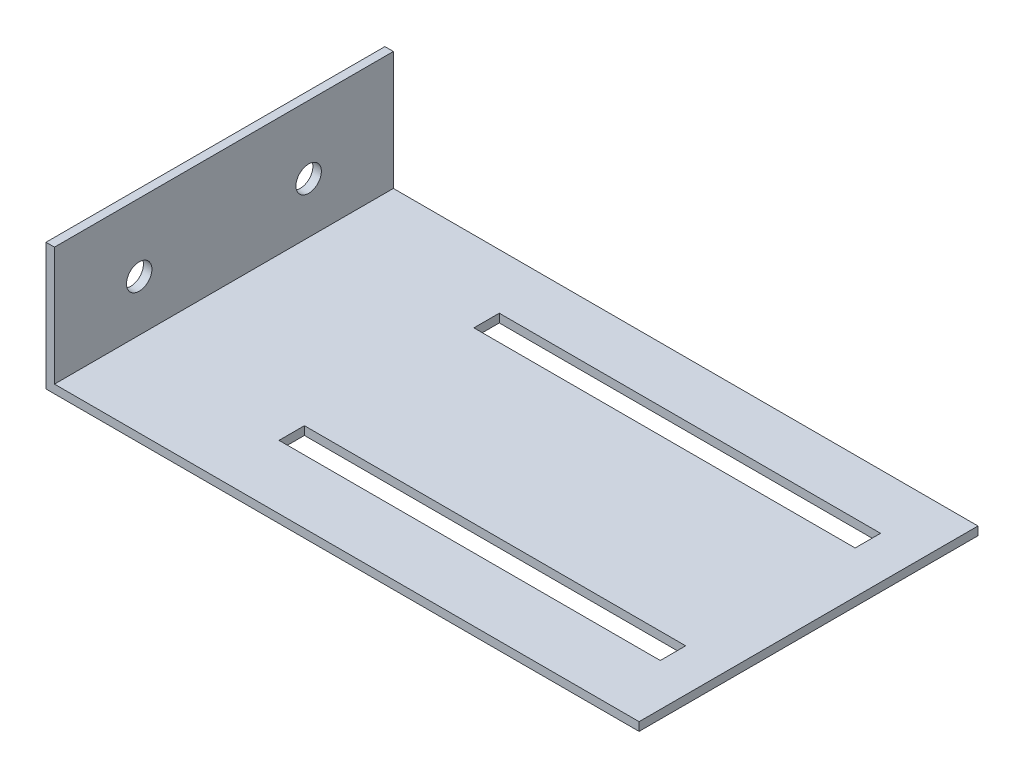
ISO-10303-21;
HEADER;
FILE_DESCRIPTION(('STEP AP214'),'2;1');
FILE_NAME('part.step','',(''),(''),'','','');
FILE_SCHEMA(('AUTOMOTIVE_DESIGN { 1 0 10303 214 1 1 1 1 }'));
ENDSEC;
DATA;
#1=APPLICATION_CONTEXT('core data for automotive mechanical design processes');
#2=APPLICATION_PROTOCOL_DEFINITION('international standard','automotive_design',2000,#1);
#3=PRODUCT_CONTEXT('',#1,'mechanical');
#4=PRODUCT('Part','Part','',(#3));
#5=PRODUCT_RELATED_PRODUCT_CATEGORY('part','',(#4));
#6=PRODUCT_DEFINITION_FORMATION('','',#4);
#7=PRODUCT_DEFINITION_CONTEXT('part definition',#1,'design');
#8=PRODUCT_DEFINITION('design','',#6,#7);
#9=PRODUCT_DEFINITION_SHAPE('','',#8);
#10=(LENGTH_UNIT() NAMED_UNIT(*) SI_UNIT(.MILLI.,.METRE.));
#11=(NAMED_UNIT(*) PLANE_ANGLE_UNIT() SI_UNIT($,.RADIAN.));
#12=(NAMED_UNIT(*) SI_UNIT($,.STERADIAN.) SOLID_ANGLE_UNIT());
#13=UNCERTAINTY_MEASURE_WITH_UNIT(LENGTH_MEASURE(1.E-05),#10,'distance_accuracy_value','');
#14=(GEOMETRIC_REPRESENTATION_CONTEXT(3) GLOBAL_UNCERTAINTY_ASSIGNED_CONTEXT((#13)) GLOBAL_UNIT_ASSIGNED_CONTEXT((#10,
#11,#12)) REPRESENTATION_CONTEXT('',''));
#15=CARTESIAN_POINT('',(0.,0.,0.));
#16=DIRECTION('',(0.,0.,1.));
#17=DIRECTION('',(1.,0.,0.));
#18=AXIS2_PLACEMENT_3D('',#15,#16,#17);
#19=CARTESIAN_POINT('',(0.,15.,40.));
#20=DIRECTION('',(1.,0.,0.));
#21=DIRECTION('',(0.,1.,0.));
#22=AXIS2_PLACEMENT_3D('',#19,#20,#21);
#23=PLANE('',#22);
#24=CARTESIAN_POINT('',(0.,7.,30.));
#25=DIRECTION('',(-1.,0.,0.));
#26=DIRECTION('',(0.,-1.,0.));
#27=AXIS2_PLACEMENT_3D('',#24,#25,#26);
#28=CIRCLE('',#27,1.5);
#29=CARTESIAN_POINT('',(0.,5.5,30.));
#30=VERTEX_POINT('',#29);
#31=EDGE_CURVE('E245',#30,#30,#28,.T.);
#32=ORIENTED_EDGE('',*,*,#31,.F.);
#33=EDGE_LOOP('',(#32));
#34=FACE_BOUND('',#33,.T.);
#35=CARTESIAN_POINT('',(0.,7.,10.));
#36=DIRECTION('',(-1.,0.,0.));
#37=DIRECTION('',(0.,-1.,0.));
#38=AXIS2_PLACEMENT_3D('',#35,#36,#37);
#39=CIRCLE('',#38,1.5);
#40=CARTESIAN_POINT('',(0.,5.5,10.));
#41=VERTEX_POINT('',#40);
#42=EDGE_CURVE('E250',#41,#41,#39,.T.);
#43=ORIENTED_EDGE('',*,*,#42,.F.);
#44=EDGE_LOOP('',(#43));
#45=FACE_BOUND('',#44,.T.);
#46=DIRECTION('',(0.,-1.,0.));
#47=VECTOR('',#46,1.);
#48=CARTESIAN_POINT('',(0.,15.,0.));
#49=LINE('',#48,#47);
#50=CARTESIAN_POINT('',(0.,15.,0.));
#51=VERTEX_POINT('',#50);
#52=CARTESIAN_POINT('',(0.,0.,0.));
#53=VERTEX_POINT('',#52);
#54=EDGE_CURVE('E204',#51,#53,#49,.T.);
#55=ORIENTED_EDGE('',*,*,#54,.T.);
#56=DIRECTION('',(0.,0.,-1.));
#57=VECTOR('',#56,1.);
#58=CARTESIAN_POINT('',(0.,0.,40.));
#59=LINE('',#58,#57);
#60=CARTESIAN_POINT('',(0.,0.,40.));
#61=VERTEX_POINT('',#60);
#62=EDGE_CURVE('E11',#61,#53,#59,.T.);
#63=ORIENTED_EDGE('',*,*,#62,.F.);
#64=DIRECTION('',(0.,-1.,0.));
#65=VECTOR('',#64,1.);
#66=CARTESIAN_POINT('',(0.,15.,40.));
#67=LINE('',#66,#65);
#68=CARTESIAN_POINT('',(0.,15.,40.));
#69=VERTEX_POINT('',#68);
#70=EDGE_CURVE('E205',#69,#61,#67,.T.);
#71=ORIENTED_EDGE('',*,*,#70,.F.);
#72=DIRECTION('',(0.,0.,-1.));
#73=VECTOR('',#72,1.);
#74=CARTESIAN_POINT('',(0.,15.,40.));
#75=LINE('',#74,#73);
#76=EDGE_CURVE('E219',#69,#51,#75,.T.);
#77=ORIENTED_EDGE('',*,*,#76,.T.);
#78=EDGE_LOOP('',(#55,#63,#71,#77));
#79=FACE_BOUND('',#78,.T.);
#80=ADVANCED_FACE('F32',(#34,#45,#79),#23,.F.);
#81=CARTESIAN_POINT('',(0.,0.,40.));
#82=DIRECTION('',(0.,1.,0.));
#83=DIRECTION('',(0.,0.,1.));
#84=AXIS2_PLACEMENT_3D('',#81,#82,#83);
#85=PLANE('',#84);
#86=DIRECTION('',(-1.,0.,0.));
#87=VECTOR('',#86,1.);
#88=CARTESIAN_POINT('',(0.,0.,6.50000000000002));
#89=LINE('',#88,#87);
#90=CARTESIAN_POINT('',(65.,0.,6.50000000000002));
#91=VERTEX_POINT('',#90);
#92=CARTESIAN_POINT('',(20.,0.,6.50000000000002));
#93=VERTEX_POINT('',#92);
#94=EDGE_CURVE('E198',#91,#93,#89,.T.);
#95=ORIENTED_EDGE('',*,*,#94,.T.);
#96=DIRECTION('',(0.,0.,1.));
#97=VECTOR('',#96,1.);
#98=CARTESIAN_POINT('',(20.,0.,40.));
#99=LINE('',#98,#97);
#100=CARTESIAN_POINT('',(20.,0.,9.50000000000002));
#101=VERTEX_POINT('',#100);
#102=EDGE_CURVE('E201',#93,#101,#99,.T.);
#103=ORIENTED_EDGE('',*,*,#102,.T.);
#104=DIRECTION('',(1.,0.,0.));
#105=VECTOR('',#104,1.);
#106=CARTESIAN_POINT('',(0.,0.,9.50000000000002));
#107=LINE('',#106,#105);
#108=CARTESIAN_POINT('',(65.,0.,9.50000000000002));
#109=VERTEX_POINT('',#108);
#110=EDGE_CURVE('E195',#101,#109,#107,.T.);
#111=ORIENTED_EDGE('',*,*,#110,.T.);
#112=DIRECTION('',(0.,0.,-1.));
#113=VECTOR('',#112,1.);
#114=CARTESIAN_POINT('',(65.,0.,40.));
#115=LINE('',#114,#113);
#116=EDGE_CURVE('E139',#109,#91,#115,.T.);
#117=ORIENTED_EDGE('',*,*,#116,.T.);
#118=EDGE_LOOP('',(#95,#103,#111,#117));
#119=FACE_BOUND('',#118,.T.);
#120=DIRECTION('',(-1.,0.,0.));
#121=VECTOR('',#120,1.);
#122=CARTESIAN_POINT('',(0.,0.,29.5));
#123=LINE('',#122,#121);
#124=CARTESIAN_POINT('',(65.,0.,29.5));
#125=VERTEX_POINT('',#124);
#126=CARTESIAN_POINT('',(20.,0.,29.5));
#127=VERTEX_POINT('',#126);
#128=EDGE_CURVE('E189',#125,#127,#123,.T.);
#129=ORIENTED_EDGE('',*,*,#128,.T.);
#130=DIRECTION('',(0.,0.,1.));
#131=VECTOR('',#130,1.);
#132=CARTESIAN_POINT('',(20.,0.,40.));
#133=LINE('',#132,#131);
#134=CARTESIAN_POINT('',(20.,0.,32.5));
#135=VERTEX_POINT('',#134);
#136=EDGE_CURVE('E192',#127,#135,#133,.T.);
#137=ORIENTED_EDGE('',*,*,#136,.T.);
#138=DIRECTION('',(1.,0.,0.));
#139=VECTOR('',#138,1.);
#140=CARTESIAN_POINT('',(0.,0.,32.5));
#141=LINE('',#140,#139);
#142=CARTESIAN_POINT('',(65.,0.,32.5));
#143=VERTEX_POINT('',#142);
#144=EDGE_CURVE('E163',#135,#143,#141,.T.);
#145=ORIENTED_EDGE('',*,*,#144,.T.);
#146=DIRECTION('',(0.,0.,-1.));
#147=VECTOR('',#146,1.);
#148=CARTESIAN_POINT('',(65.,0.,40.));
#149=LINE('',#148,#147);
#150=EDGE_CURVE('E186',#143,#125,#149,.T.);
#151=ORIENTED_EDGE('',*,*,#150,.T.);
#152=EDGE_LOOP('',(#129,#137,#145,#151));
#153=FACE_BOUND('',#152,.T.);
#154=DIRECTION('',(1.,0.,0.));
#155=VECTOR('',#154,1.);
#156=CARTESIAN_POINT('',(0.,0.,0.));
#157=LINE('',#156,#155);
#158=CARTESIAN_POINT('',(70.,0.,0.));
#159=VERTEX_POINT('',#158);
#160=EDGE_CURVE('E222',#53,#159,#157,.T.);
#161=ORIENTED_EDGE('',*,*,#160,.T.);
#162=DIRECTION('',(0.,0.,-1.));
#163=VECTOR('',#162,1.);
#164=CARTESIAN_POINT('',(70.,0.,40.));
#165=LINE('',#164,#163);
#166=CARTESIAN_POINT('',(70.,0.,40.));
#167=VERTEX_POINT('',#166);
#168=EDGE_CURVE('E40',#167,#159,#165,.T.);
#169=ORIENTED_EDGE('',*,*,#168,.F.);
#170=DIRECTION('',(1.,0.,0.));
#171=VECTOR('',#170,1.);
#172=CARTESIAN_POINT('',(0.,0.,40.));
#173=LINE('',#172,#171);
#174=EDGE_CURVE('E208',#61,#167,#173,.T.);
#175=ORIENTED_EDGE('',*,*,#174,.F.);
#176=ORIENTED_EDGE('',*,*,#62,.T.);
#177=EDGE_LOOP('',(#161,#169,#175,#176));
#178=FACE_BOUND('',#177,.T.);
#179=ADVANCED_FACE('F262',(#119,#153,#178),#85,.F.);
#180=CARTESIAN_POINT('',(70.,0.,40.));
#181=DIRECTION('',(-1.,0.,0.));
#182=DIRECTION('',(0.,0.,1.));
#183=AXIS2_PLACEMENT_3D('',#180,#181,#182);
#184=PLANE('',#183);
#185=DIRECTION('',(0.,1.,0.));
#186=VECTOR('',#185,1.);
#187=CARTESIAN_POINT('',(70.,0.,0.));
#188=LINE('',#187,#186);
#189=CARTESIAN_POINT('',(70.,1.,0.));
#190=VERTEX_POINT('',#189);
#191=EDGE_CURVE('E224',#159,#190,#188,.T.);
#192=ORIENTED_EDGE('',*,*,#191,.T.);
#193=DIRECTION('',(0.,0.,-1.));
#194=VECTOR('',#193,1.);
#195=CARTESIAN_POINT('',(70.,1.,40.));
#196=LINE('',#195,#194);
#197=CARTESIAN_POINT('',(70.,1.,40.));
#198=VERTEX_POINT('',#197);
#199=EDGE_CURVE('E239',#198,#190,#196,.T.);
#200=ORIENTED_EDGE('',*,*,#199,.F.);
#201=DIRECTION('',(0.,1.,0.));
#202=VECTOR('',#201,1.);
#203=CARTESIAN_POINT('',(70.,0.,40.));
#204=LINE('',#203,#202);
#205=EDGE_CURVE('E211',#167,#198,#204,.T.);
#206=ORIENTED_EDGE('',*,*,#205,.F.);
#207=ORIENTED_EDGE('',*,*,#168,.T.);
#208=EDGE_LOOP('',(#192,#200,#206,#207));
#209=FACE_BOUND('',#208,.T.);
#210=ADVANCED_FACE('F265',(#209),#184,.F.);
#211=CARTESIAN_POINT('',(70.,1.,40.));
#212=DIRECTION('',(0.,-1.,0.));
#213=DIRECTION('',(1.,0.,0.));
#214=AXIS2_PLACEMENT_3D('',#211,#212,#213);
#215=PLANE('',#214);
#216=DIRECTION('',(1.,0.,0.));
#217=VECTOR('',#216,1.);
#218=CARTESIAN_POINT('',(20.,1.,9.50000000000002));
#219=LINE('',#218,#217);
#220=CARTESIAN_POINT('',(20.,1.,9.50000000000002));
#221=VERTEX_POINT('',#220);
#222=CARTESIAN_POINT('',(65.,1.,9.50000000000002));
#223=VERTEX_POINT('',#222);
#224=EDGE_CURVE('E146',#221,#223,#219,.T.);
#225=ORIENTED_EDGE('',*,*,#224,.F.);
#226=DIRECTION('',(0.,0.,1.));
#227=VECTOR('',#226,1.);
#228=CARTESIAN_POINT('',(20.,1.,6.50000000000002));
#229=LINE('',#228,#227);
#230=CARTESIAN_POINT('',(20.,1.,6.50000000000002));
#231=VERTEX_POINT('',#230);
#232=EDGE_CURVE('E151',#231,#221,#229,.T.);
#233=ORIENTED_EDGE('',*,*,#232,.F.);
#234=DIRECTION('',(-1.,0.,0.));
#235=VECTOR('',#234,1.);
#236=CARTESIAN_POINT('',(20.,1.,6.50000000000002));
#237=LINE('',#236,#235);
#238=CARTESIAN_POINT('',(65.,1.,6.50000000000002));
#239=VERTEX_POINT('',#238);
#240=EDGE_CURVE('E156',#239,#231,#237,.T.);
#241=ORIENTED_EDGE('',*,*,#240,.F.);
#242=DIRECTION('',(0.,0.,-1.));
#243=VECTOR('',#242,1.);
#244=CARTESIAN_POINT('',(65.,1.,6.50000000000002));
#245=LINE('',#244,#243);
#246=EDGE_CURVE('E136',#223,#239,#245,.T.);
#247=ORIENTED_EDGE('',*,*,#246,.F.);
#248=EDGE_LOOP('',(#225,#233,#241,#247));
#249=FACE_BOUND('',#248,.T.);
#250=DIRECTION('',(1.,0.,0.));
#251=VECTOR('',#250,1.);
#252=CARTESIAN_POINT('',(20.,1.,32.5));
#253=LINE('',#252,#251);
#254=CARTESIAN_POINT('',(20.,1.,32.5));
#255=VERTEX_POINT('',#254);
#256=CARTESIAN_POINT('',(65.,1.,32.5));
#257=VERTEX_POINT('',#256);
#258=EDGE_CURVE('E168',#255,#257,#253,.T.);
#259=ORIENTED_EDGE('',*,*,#258,.F.);
#260=DIRECTION('',(0.,0.,1.));
#261=VECTOR('',#260,1.);
#262=CARTESIAN_POINT('',(20.,1.,32.5));
#263=LINE('',#262,#261);
#264=CARTESIAN_POINT('',(20.,1.,29.5));
#265=VERTEX_POINT('',#264);
#266=EDGE_CURVE('E166',#265,#255,#263,.T.);
#267=ORIENTED_EDGE('',*,*,#266,.F.);
#268=DIRECTION('',(-1.,0.,0.));
#269=VECTOR('',#268,1.);
#270=CARTESIAN_POINT('',(20.,1.,29.5));
#271=LINE('',#270,#269);
#272=CARTESIAN_POINT('',(65.,1.,29.5));
#273=VERTEX_POINT('',#272);
#274=EDGE_CURVE('E173',#273,#265,#271,.T.);
#275=ORIENTED_EDGE('',*,*,#274,.F.);
#276=DIRECTION('',(0.,0.,-1.));
#277=VECTOR('',#276,1.);
#278=CARTESIAN_POINT('',(65.,1.,32.5));
#279=LINE('',#278,#277);
#280=EDGE_CURVE('E170',#257,#273,#279,.T.);
#281=ORIENTED_EDGE('',*,*,#280,.F.);
#282=EDGE_LOOP('',(#259,#267,#275,#281));
#283=FACE_BOUND('',#282,.T.);
#284=DIRECTION('',(-1.,0.,0.));
#285=VECTOR('',#284,1.);
#286=CARTESIAN_POINT('',(70.,1.,0.));
#287=LINE('',#286,#285);
#288=CARTESIAN_POINT('',(1.00000000000001,1.,0.));
#289=VERTEX_POINT('',#288);
#290=EDGE_CURVE('E226',#190,#289,#287,.T.);
#291=ORIENTED_EDGE('',*,*,#290,.T.);
#292=DIRECTION('',(0.,0.,-1.));
#293=VECTOR('',#292,1.);
#294=CARTESIAN_POINT('',(1.00000000000001,1.,40.));
#295=LINE('',#294,#293);
#296=CARTESIAN_POINT('',(1.00000000000001,1.,40.));
#297=VERTEX_POINT('',#296);
#298=EDGE_CURVE('E236',#297,#289,#295,.T.);
#299=ORIENTED_EDGE('',*,*,#298,.F.);
#300=DIRECTION('',(-1.,0.,0.));
#301=VECTOR('',#300,1.);
#302=CARTESIAN_POINT('',(70.,1.,40.));
#303=LINE('',#302,#301);
#304=EDGE_CURVE('E213',#198,#297,#303,.T.);
#305=ORIENTED_EDGE('',*,*,#304,.F.);
#306=ORIENTED_EDGE('',*,*,#199,.T.);
#307=EDGE_LOOP('',(#291,#299,#305,#306));
#308=FACE_BOUND('',#307,.T.);
#309=ADVANCED_FACE('F153',(#249,#283,#308),#215,.F.);
#310=CARTESIAN_POINT('',(1.00000000000001,1.,40.));
#311=DIRECTION('',(-1.,0.,0.));
#312=DIRECTION('',(0.,0.,1.));
#313=AXIS2_PLACEMENT_3D('',#310,#311,#312);
#314=PLANE('',#313);
#315=CARTESIAN_POINT('',(1.00000000000001,7.,30.));
#316=DIRECTION('',(-1.,0.,0.));
#317=DIRECTION('',(0.,0.,1.));
#318=AXIS2_PLACEMENT_3D('',#315,#316,#317);
#319=CIRCLE('',#318,1.5);
#320=CARTESIAN_POINT('',(1.00000000000001,7.,31.5));
#321=VERTEX_POINT('',#320);
#322=EDGE_CURVE('E35',#321,#321,#319,.T.);
#323=ORIENTED_EDGE('',*,*,#322,.T.);
#324=EDGE_LOOP('',(#323));
#325=FACE_BOUND('',#324,.T.);
#326=CARTESIAN_POINT('',(1.00000000000001,7.,10.));
#327=DIRECTION('',(-1.,0.,0.));
#328=DIRECTION('',(0.,0.,1.));
#329=AXIS2_PLACEMENT_3D('',#326,#327,#328);
#330=CIRCLE('',#329,1.5);
#331=CARTESIAN_POINT('',(1.00000000000001,7.,11.5));
#332=VERTEX_POINT('',#331);
#333=EDGE_CURVE('E243',#332,#332,#330,.T.);
#334=ORIENTED_EDGE('',*,*,#333,.T.);
#335=EDGE_LOOP('',(#334));
#336=FACE_BOUND('',#335,.T.);
#337=DIRECTION('',(0.,1.,0.));
#338=VECTOR('',#337,1.);
#339=CARTESIAN_POINT('',(1.00000000000001,1.,0.));
#340=LINE('',#339,#338);
#341=CARTESIAN_POINT('',(1.00000000000001,15.,0.));
#342=VERTEX_POINT('',#341);
#343=EDGE_CURVE('E228',#289,#342,#340,.T.);
#344=ORIENTED_EDGE('',*,*,#343,.T.);
#345=DIRECTION('',(0.,0.,-1.));
#346=VECTOR('',#345,1.);
#347=CARTESIAN_POINT('',(1.00000000000001,15.,40.));
#348=LINE('',#347,#346);
#349=CARTESIAN_POINT('',(1.00000000000001,15.,40.));
#350=VERTEX_POINT('',#349);
#351=EDGE_CURVE('E233',#350,#342,#348,.T.);
#352=ORIENTED_EDGE('',*,*,#351,.F.);
#353=DIRECTION('',(0.,1.,0.));
#354=VECTOR('',#353,1.);
#355=CARTESIAN_POINT('',(1.00000000000001,1.,40.));
#356=LINE('',#355,#354);
#357=EDGE_CURVE('E215',#297,#350,#356,.T.);
#358=ORIENTED_EDGE('',*,*,#357,.F.);
#359=ORIENTED_EDGE('',*,*,#298,.T.);
#360=EDGE_LOOP('',(#344,#352,#358,#359));
#361=FACE_BOUND('',#360,.T.);
#362=ADVANCED_FACE('F284',(#325,#336,#361),#314,.F.);
#363=CARTESIAN_POINT('',(1.00000000000001,15.,40.));
#364=DIRECTION('',(0.,-1.,0.));
#365=DIRECTION('',(0.,0.,-1.));
#366=AXIS2_PLACEMENT_3D('',#363,#364,#365);
#367=PLANE('',#366);
#368=DIRECTION('',(-1.,0.,0.));
#369=VECTOR('',#368,1.);
#370=CARTESIAN_POINT('',(1.00000000000001,15.,0.));
#371=LINE('',#370,#369);
#372=EDGE_CURVE('E209',#342,#51,#371,.T.);
#373=ORIENTED_EDGE('',*,*,#372,.T.);
#374=ORIENTED_EDGE('',*,*,#76,.F.);
#375=DIRECTION('',(-1.,0.,0.));
#376=VECTOR('',#375,1.);
#377=CARTESIAN_POINT('',(1.00000000000001,15.,40.));
#378=LINE('',#377,#376);
#379=EDGE_CURVE('E217',#350,#69,#378,.T.);
#380=ORIENTED_EDGE('',*,*,#379,.F.);
#381=ORIENTED_EDGE('',*,*,#351,.T.);
#382=EDGE_LOOP('',(#373,#374,#380,#381));
#383=FACE_BOUND('',#382,.T.);
#384=ADVANCED_FACE('F293',(#383),#367,.F.);
#385=CARTESIAN_POINT('',(0.,0.,40.));
#386=DIRECTION('',(0.,0.,1.));
#387=DIRECTION('',(1.,0.,0.));
#388=AXIS2_PLACEMENT_3D('',#385,#386,#387);
#389=PLANE('',#388);
#390=ORIENTED_EDGE('',*,*,#70,.T.);
#391=ORIENTED_EDGE('',*,*,#174,.T.);
#392=ORIENTED_EDGE('',*,*,#205,.T.);
#393=ORIENTED_EDGE('',*,*,#304,.T.);
#394=ORIENTED_EDGE('',*,*,#357,.T.);
#395=ORIENTED_EDGE('',*,*,#379,.T.);
#396=EDGE_LOOP('',(#390,#391,#392,#393,#394,#395));
#397=FACE_BOUND('',#396,.T.);
#398=ADVANCED_FACE('F288',(#397),#389,.T.);
#399=CARTESIAN_POINT('',(0.,0.,0.));
#400=DIRECTION('',(0.,0.,1.));
#401=DIRECTION('',(1.,0.,0.));
#402=AXIS2_PLACEMENT_3D('',#399,#400,#401);
#403=PLANE('',#402);
#404=ORIENTED_EDGE('',*,*,#54,.F.);
#405=ORIENTED_EDGE('',*,*,#372,.F.);
#406=ORIENTED_EDGE('',*,*,#343,.F.);
#407=ORIENTED_EDGE('',*,*,#290,.F.);
#408=ORIENTED_EDGE('',*,*,#191,.F.);
#409=ORIENTED_EDGE('',*,*,#160,.F.);
#410=EDGE_LOOP('',(#404,#405,#406,#407,#408,#409));
#411=FACE_BOUND('',#410,.T.);
#412=ADVANCED_FACE('F276',(#411),#403,.F.);
#413=CARTESIAN_POINT('',(20.,-9.,32.5));
#414=DIRECTION('',(-1.,0.,0.));
#415=DIRECTION('',(0.,0.,1.));
#416=AXIS2_PLACEMENT_3D('',#413,#414,#415);
#417=PLANE('',#416);
#418=DIRECTION('',(0.,1.,0.));
#419=VECTOR('',#418,1.);
#420=CARTESIAN_POINT('',(20.,-9.,29.5));
#421=LINE('',#420,#419);
#422=EDGE_CURVE('E177',#127,#265,#421,.T.);
#423=ORIENTED_EDGE('',*,*,#422,.T.);
#424=ORIENTED_EDGE('',*,*,#266,.T.);
#425=DIRECTION('',(0.,1.,0.));
#426=VECTOR('',#425,1.);
#427=CARTESIAN_POINT('',(20.,-9.,32.5));
#428=LINE('',#427,#426);
#429=EDGE_CURVE('E176',#135,#255,#428,.T.);
#430=ORIENTED_EDGE('',*,*,#429,.F.);
#431=ORIENTED_EDGE('',*,*,#136,.F.);
#432=EDGE_LOOP('',(#423,#424,#430,#431));
#433=FACE_BOUND('',#432,.T.);
#434=ADVANCED_FACE('F334',(#433),#417,.F.);
#435=CARTESIAN_POINT('',(20.,-9.,29.5));
#436=DIRECTION('',(0.,0.,-1.));
#437=DIRECTION('',(-1.,0.,0.));
#438=AXIS2_PLACEMENT_3D('',#435,#436,#437);
#439=PLANE('',#438);
#440=DIRECTION('',(0.,1.,0.));
#441=VECTOR('',#440,1.);
#442=CARTESIAN_POINT('',(65.,-9.,29.5));
#443=LINE('',#442,#441);
#444=EDGE_CURVE('E179',#125,#273,#443,.T.);
#445=ORIENTED_EDGE('',*,*,#444,.T.);
#446=ORIENTED_EDGE('',*,*,#274,.T.);
#447=ORIENTED_EDGE('',*,*,#422,.F.);
#448=ORIENTED_EDGE('',*,*,#128,.F.);
#449=EDGE_LOOP('',(#445,#446,#447,#448));
#450=FACE_BOUND('',#449,.T.);
#451=ADVANCED_FACE('F330',(#450),#439,.F.);
#452=CARTESIAN_POINT('',(65.,-9.,32.5));
#453=DIRECTION('',(1.,0.,0.));
#454=DIRECTION('',(0.,0.,-1.));
#455=AXIS2_PLACEMENT_3D('',#452,#453,#454);
#456=PLANE('',#455);
#457=DIRECTION('',(0.,1.,0.));
#458=VECTOR('',#457,1.);
#459=CARTESIAN_POINT('',(65.,-9.,32.5));
#460=LINE('',#459,#458);
#461=EDGE_CURVE('E56',#143,#257,#460,.T.);
#462=ORIENTED_EDGE('',*,*,#461,.T.);
#463=ORIENTED_EDGE('',*,*,#280,.T.);
#464=ORIENTED_EDGE('',*,*,#444,.F.);
#465=ORIENTED_EDGE('',*,*,#150,.F.);
#466=EDGE_LOOP('',(#462,#463,#464,#465));
#467=FACE_BOUND('',#466,.T.);
#468=ADVANCED_FACE('F333',(#467),#456,.F.);
#469=CARTESIAN_POINT('',(20.,-9.,32.5));
#470=DIRECTION('',(0.,0.,1.));
#471=DIRECTION('',(1.,0.,0.));
#472=AXIS2_PLACEMENT_3D('',#469,#470,#471);
#473=PLANE('',#472);
#474=ORIENTED_EDGE('',*,*,#429,.T.);
#475=ORIENTED_EDGE('',*,*,#258,.T.);
#476=ORIENTED_EDGE('',*,*,#461,.F.);
#477=ORIENTED_EDGE('',*,*,#144,.F.);
#478=EDGE_LOOP('',(#474,#475,#476,#477));
#479=FACE_BOUND('',#478,.T.);
#480=ADVANCED_FACE('F329',(#479),#473,.F.);
#481=CARTESIAN_POINT('',(20.,-9.,6.50000000000002));
#482=DIRECTION('',(-1.,0.,0.));
#483=DIRECTION('',(0.,0.,1.));
#484=AXIS2_PLACEMENT_3D('',#481,#482,#483);
#485=PLANE('',#484);
#486=DIRECTION('',(0.,1.,0.));
#487=VECTOR('',#486,1.);
#488=CARTESIAN_POINT('',(20.,-9.,6.50000000000002));
#489=LINE('',#488,#487);
#490=EDGE_CURVE('E161',#93,#231,#489,.T.);
#491=ORIENTED_EDGE('',*,*,#490,.T.);
#492=ORIENTED_EDGE('',*,*,#232,.T.);
#493=DIRECTION('',(0.,1.,0.));
#494=VECTOR('',#493,1.);
#495=CARTESIAN_POINT('',(20.,-9.,9.50000000000002));
#496=LINE('',#495,#494);
#497=EDGE_CURVE('E142',#101,#221,#496,.T.);
#498=ORIENTED_EDGE('',*,*,#497,.F.);
#499=ORIENTED_EDGE('',*,*,#102,.F.);
#500=EDGE_LOOP('',(#491,#492,#498,#499));
#501=FACE_BOUND('',#500,.T.);
#502=ADVANCED_FACE('F257',(#501),#485,.F.);
#503=CARTESIAN_POINT('',(20.,-9.,6.50000000000002));
#504=DIRECTION('',(0.,0.,-1.));
#505=DIRECTION('',(-1.,0.,0.));
#506=AXIS2_PLACEMENT_3D('',#503,#504,#505);
#507=PLANE('',#506);
#508=DIRECTION('',(0.,1.,0.));
#509=VECTOR('',#508,1.);
#510=CARTESIAN_POINT('',(65.,-9.,6.50000000000002));
#511=LINE('',#510,#509);
#512=EDGE_CURVE('E141',#91,#239,#511,.T.);
#513=ORIENTED_EDGE('',*,*,#512,.T.);
#514=ORIENTED_EDGE('',*,*,#240,.T.);
#515=ORIENTED_EDGE('',*,*,#490,.F.);
#516=ORIENTED_EDGE('',*,*,#94,.F.);
#517=EDGE_LOOP('',(#513,#514,#515,#516));
#518=FACE_BOUND('',#517,.T.);
#519=ADVANCED_FACE('F260',(#518),#507,.F.);
#520=CARTESIAN_POINT('',(65.,-9.,6.50000000000002));
#521=DIRECTION('',(1.,0.,0.));
#522=DIRECTION('',(0.,0.,-1.));
#523=AXIS2_PLACEMENT_3D('',#520,#521,#522);
#524=PLANE('',#523);
#525=DIRECTION('',(0.,1.,0.));
#526=VECTOR('',#525,1.);
#527=CARTESIAN_POINT('',(65.,-9.,9.50000000000002));
#528=LINE('',#527,#526);
#529=EDGE_CURVE('E48',#109,#223,#528,.T.);
#530=ORIENTED_EDGE('',*,*,#529,.T.);
#531=ORIENTED_EDGE('',*,*,#246,.T.);
#532=ORIENTED_EDGE('',*,*,#512,.F.);
#533=ORIENTED_EDGE('',*,*,#116,.F.);
#534=EDGE_LOOP('',(#530,#531,#532,#533));
#535=FACE_BOUND('',#534,.T.);
#536=ADVANCED_FACE('F133',(#535),#524,.F.);
#537=CARTESIAN_POINT('',(20.,-9.,9.50000000000002));
#538=DIRECTION('',(0.,0.,1.));
#539=DIRECTION('',(1.,0.,0.));
#540=AXIS2_PLACEMENT_3D('',#537,#538,#539);
#541=PLANE('',#540);
#542=ORIENTED_EDGE('',*,*,#497,.T.);
#543=ORIENTED_EDGE('',*,*,#224,.T.);
#544=ORIENTED_EDGE('',*,*,#529,.F.);
#545=ORIENTED_EDGE('',*,*,#110,.F.);
#546=EDGE_LOOP('',(#542,#543,#544,#545));
#547=FACE_BOUND('',#546,.T.);
#548=ADVANCED_FACE('F147',(#547),#541,.F.);
#549=CARTESIAN_POINT('',(10.,7.,10.));
#550=DIRECTION('',(-1.,0.,0.));
#551=DIRECTION('',(0.,-1.,0.));
#552=AXIS2_PLACEMENT_3D('',#549,#550,#551);
#553=CYLINDRICAL_SURFACE('',#552,1.5);
#554=ORIENTED_EDGE('',*,*,#42,.T.);
#555=EDGE_LOOP('',(#554));
#556=FACE_BOUND('',#555,.T.);
#557=ORIENTED_EDGE('',*,*,#333,.F.);
#558=EDGE_LOOP('',(#557));
#559=FACE_BOUND('',#558,.T.);
#560=ADVANCED_FACE('F311',(#556,#559),#553,.F.);
#561=CARTESIAN_POINT('',(10.,7.,30.));
#562=DIRECTION('',(-1.,0.,0.));
#563=DIRECTION('',(0.,-1.,0.));
#564=AXIS2_PLACEMENT_3D('',#561,#562,#563);
#565=CYLINDRICAL_SURFACE('',#564,1.5);
#566=ORIENTED_EDGE('',*,*,#31,.T.);
#567=EDGE_LOOP('',(#566));
#568=FACE_BOUND('',#567,.T.);
#569=ORIENTED_EDGE('',*,*,#322,.F.);
#570=EDGE_LOOP('',(#569));
#571=FACE_BOUND('',#570,.T.);
#572=ADVANCED_FACE('F314',(#568,#571),#565,.F.);
#573=CLOSED_SHELL('',(#80,#179,#210,#309,#362,#384,#398,#412,#434,#451,#468,#480,#502,#519,#536,
#548,#560,#572));
#574=MANIFOLD_SOLID_BREP('B2',#573);
#575=ADVANCED_BREP_SHAPE_REPRESENTATION('',(#18,#574),#14);
#576=SHAPE_DEFINITION_REPRESENTATION(#9,#575);
ENDSEC;
END-ISO-10303-21;
